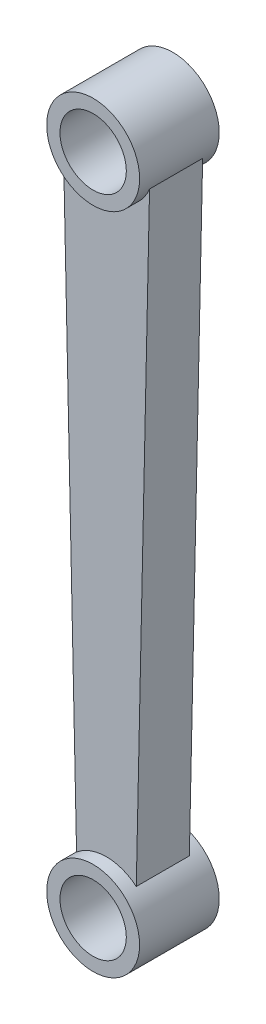
ISO-10303-21;
HEADER;
FILE_DESCRIPTION(('STEP AP214'),'2;1');
FILE_NAME('part.step','',(''),(''),'','','');
FILE_SCHEMA(('AUTOMOTIVE_DESIGN { 1 0 10303 214 1 1 1 1 }'));
ENDSEC;
DATA;
#1=APPLICATION_CONTEXT('core data for automotive mechanical design processes');
#2=APPLICATION_PROTOCOL_DEFINITION('international standard','automotive_design',2000,#1);
#3=PRODUCT_CONTEXT('',#1,'mechanical');
#4=PRODUCT('Part','Part','',(#3));
#5=PRODUCT_RELATED_PRODUCT_CATEGORY('part','',(#4));
#6=PRODUCT_DEFINITION_FORMATION('','',#4);
#7=PRODUCT_DEFINITION_CONTEXT('part definition',#1,'design');
#8=PRODUCT_DEFINITION('design','',#6,#7);
#9=PRODUCT_DEFINITION_SHAPE('','',#8);
#10=(LENGTH_UNIT() NAMED_UNIT(*) SI_UNIT(.MILLI.,.METRE.));
#11=(NAMED_UNIT(*) PLANE_ANGLE_UNIT() SI_UNIT($,.RADIAN.));
#12=(NAMED_UNIT(*) SI_UNIT($,.STERADIAN.) SOLID_ANGLE_UNIT());
#13=UNCERTAINTY_MEASURE_WITH_UNIT(LENGTH_MEASURE(1.E-05),#10,'distance_accuracy_value','');
#14=(GEOMETRIC_REPRESENTATION_CONTEXT(3) GLOBAL_UNCERTAINTY_ASSIGNED_CONTEXT((#13)) GLOBAL_UNIT_ASSIGNED_CONTEXT((#10,
#11,#12)) REPRESENTATION_CONTEXT('',''));
#15=CARTESIAN_POINT('',(0.,0.,0.));
#16=DIRECTION('',(0.,0.,1.));
#17=DIRECTION('',(1.,0.,0.));
#18=AXIS2_PLACEMENT_3D('',#15,#16,#17);
#19=CARTESIAN_POINT('',(0.,0.,-1.5));
#20=DIRECTION('',(0.,0.,1.));
#21=DIRECTION('',(1.,0.,0.));
#22=AXIS2_PLACEMENT_3D('',#19,#20,#21);
#23=CYLINDRICAL_SURFACE('',#22,1.75);
#24=CARTESIAN_POINT('',(0.,0.,1.));
#25=DIRECTION('',(0.,0.,1.));
#26=DIRECTION('',(1.,0.,0.));
#27=AXIS2_PLACEMENT_3D('',#24,#25,#26);
#28=CIRCLE('',#27,1.75);
#29=CARTESIAN_POINT('',(1.625,-0.649519052838329,1.));
#30=VERTEX_POINT('',#29);
#31=CARTESIAN_POINT('',(-1.625,-0.64951905283833,1.));
#32=VERTEX_POINT('',#31);
#33=EDGE_CURVE('E102',#30,#32,#28,.F.);
#34=ORIENTED_EDGE('',*,*,#33,.F.);
#35=DIRECTION('',(0.,0.,1.));
#36=VECTOR('',#35,1.);
#37=CARTESIAN_POINT('',(1.625,-0.649519052838329,-1.));
#38=LINE('',#37,#36);
#39=CARTESIAN_POINT('',(1.625,-0.649519052838332,-1.));
#40=VERTEX_POINT('',#39);
#41=EDGE_CURVE('E54',#40,#30,#38,.T.);
#42=ORIENTED_EDGE('',*,*,#41,.F.);
#43=CARTESIAN_POINT('',(0.,0.,-1.));
#44=DIRECTION('',(0.,0.,1.));
#45=DIRECTION('',(1.,0.,0.));
#46=AXIS2_PLACEMENT_3D('',#43,#44,#45);
#47=CIRCLE('',#46,1.75);
#48=CARTESIAN_POINT('',(-1.625,-0.649519052838331,-1.));
#49=VERTEX_POINT('',#48);
#50=EDGE_CURVE('E58',#40,#49,#47,.F.);
#51=ORIENTED_EDGE('',*,*,#50,.T.);
#52=DIRECTION('',(0.,0.,1.));
#53=VECTOR('',#52,1.);
#54=CARTESIAN_POINT('',(-1.625,-0.64951905283833,-1.));
#55=LINE('',#54,#53);
#56=EDGE_CURVE('E117',#49,#32,#55,.T.);
#57=ORIENTED_EDGE('',*,*,#56,.T.);
#58=EDGE_LOOP('',(#34,#42,#51,#57));
#59=FACE_BOUND('',#58,.T.);
#60=CARTESIAN_POINT('',(0.,0.,1.5));
#61=DIRECTION('',(0.,0.,1.));
#62=DIRECTION('',(1.,0.,0.));
#63=AXIS2_PLACEMENT_3D('',#60,#61,#62);
#64=CIRCLE('',#63,1.75);
#65=CARTESIAN_POINT('',(1.75,0.,1.5));
#66=VERTEX_POINT('',#65);
#67=EDGE_CURVE('E132',#66,#66,#64,.T.);
#68=ORIENTED_EDGE('',*,*,#67,.F.);
#69=EDGE_LOOP('',(#68));
#70=FACE_BOUND('',#69,.T.);
#71=CARTESIAN_POINT('',(0.,0.,-1.5));
#72=DIRECTION('',(0.,0.,1.));
#73=DIRECTION('',(1.,0.,0.));
#74=AXIS2_PLACEMENT_3D('',#71,#72,#73);
#75=CIRCLE('',#74,1.75);
#76=CARTESIAN_POINT('',(1.75,0.,-1.5));
#77=VERTEX_POINT('',#76);
#78=EDGE_CURVE('E47',#77,#77,#75,.T.);
#79=ORIENTED_EDGE('',*,*,#78,.T.);
#80=EDGE_LOOP('',(#79));
#81=FACE_BOUND('',#80,.T.);
#82=ADVANCED_FACE('F39',(#59,#70,#81),#23,.T.);
#83=CARTESIAN_POINT('',(0.,0.,-1.5));
#84=DIRECTION('',(0.,0.,1.));
#85=DIRECTION('',(1.,0.,0.));
#86=AXIS2_PLACEMENT_3D('',#83,#84,#85);
#87=PLANE('',#86);
#88=CARTESIAN_POINT('',(0.,0.,-1.5));
#89=DIRECTION('',(0.,0.,1.));
#90=DIRECTION('',(1.,0.,0.));
#91=AXIS2_PLACEMENT_3D('',#88,#89,#90);
#92=CIRCLE('',#91,1.25);
#93=CARTESIAN_POINT('',(1.25,0.,-1.5));
#94=VERTEX_POINT('',#93);
#95=EDGE_CURVE('E136',#94,#94,#92,.T.);
#96=ORIENTED_EDGE('',*,*,#95,.T.);
#97=EDGE_LOOP('',(#96));
#98=FACE_BOUND('',#97,.T.);
#99=ORIENTED_EDGE('',*,*,#78,.F.);
#100=EDGE_LOOP('',(#99));
#101=FACE_BOUND('',#100,.T.);
#102=ADVANCED_FACE('F144',(#98,#101),#87,.F.);
#103=CARTESIAN_POINT('',(0.,0.,-1.5));
#104=DIRECTION('',(0.,0.,1.));
#105=DIRECTION('',(1.,0.,0.));
#106=AXIS2_PLACEMENT_3D('',#103,#104,#105);
#107=CYLINDRICAL_SURFACE('',#106,1.25);
#108=CARTESIAN_POINT('',(0.,0.,1.5));
#109=DIRECTION('',(0.,0.,1.));
#110=DIRECTION('',(1.,0.,0.));
#111=AXIS2_PLACEMENT_3D('',#108,#109,#110);
#112=CIRCLE('',#111,1.25);
#113=CARTESIAN_POINT('',(1.25,0.,1.5));
#114=VERTEX_POINT('',#113);
#115=EDGE_CURVE('E128',#114,#114,#112,.T.);
#116=ORIENTED_EDGE('',*,*,#115,.T.);
#117=EDGE_LOOP('',(#116));
#118=FACE_BOUND('',#117,.T.);
#119=ORIENTED_EDGE('',*,*,#95,.F.);
#120=EDGE_LOOP('',(#119));
#121=FACE_BOUND('',#120,.T.);
#122=ADVANCED_FACE('F146',(#118,#121),#107,.F.);
#123=CARTESIAN_POINT('',(0.,0.,1.5));
#124=DIRECTION('',(0.,0.,1.));
#125=DIRECTION('',(1.,0.,0.));
#126=AXIS2_PLACEMENT_3D('',#123,#124,#125);
#127=PLANE('',#126);
#128=ORIENTED_EDGE('',*,*,#67,.T.);
#129=EDGE_LOOP('',(#128));
#130=FACE_BOUND('',#129,.T.);
#131=ORIENTED_EDGE('',*,*,#115,.F.);
#132=EDGE_LOOP('',(#131));
#133=FACE_BOUND('',#132,.T.);
#134=ADVANCED_FACE('F152',(#130,#133),#127,.T.);
#135=CARTESIAN_POINT('',(1.625,-0.649519052838329,-1.));
#136=DIRECTION('',(0.99976399412678,-0.0217245494238276,0.));
#137=DIRECTION('',(0.0217245494238276,0.99976399412678,0.));
#138=AXIS2_PLACEMENT_3D('',#135,#136,#137);
#139=PLANE('',#138);
#140=ORIENTED_EDGE('',*,*,#41,.T.);
#141=DIRECTION('',(0.0217245494238276,0.99976399412678,0.));
#142=VECTOR('',#141,1.);
#143=CARTESIAN_POINT('',(1.625,-0.649519052838329,1.));
#144=LINE('',#143,#142);
#145=CARTESIAN_POINT('',(1.125,-23.6595243381546,1.));
#146=VERTEX_POINT('',#145);
#147=EDGE_CURVE('E78',#146,#30,#144,.T.);
#148=ORIENTED_EDGE('',*,*,#147,.F.);
#149=DIRECTION('',(0.,0.,1.));
#150=VECTOR('',#149,1.);
#151=CARTESIAN_POINT('',(1.125,-23.6595243381546,-1.));
#152=LINE('',#151,#150);
#153=CARTESIAN_POINT('',(1.125,-23.6595243381546,-1.));
#154=VERTEX_POINT('',#153);
#155=EDGE_CURVE('E82',#154,#146,#152,.T.);
#156=ORIENTED_EDGE('',*,*,#155,.F.);
#157=DIRECTION('',(0.0217245494238276,0.99976399412678,0.));
#158=VECTOR('',#157,1.);
#159=CARTESIAN_POINT('',(1.625,-0.649519052838329,-1.));
#160=LINE('',#159,#158);
#161=EDGE_CURVE('E114',#154,#40,#160,.T.);
#162=ORIENTED_EDGE('',*,*,#161,.T.);
#163=EDGE_LOOP('',(#140,#148,#156,#162));
#164=FACE_BOUND('',#163,.T.);
#165=ADVANCED_FACE('F80',(#164),#139,.T.);
#166=CARTESIAN_POINT('',(0.,-25.,-1.));
#167=DIRECTION('',(0.,0.,1.));
#168=DIRECTION('',(1.,0.,0.));
#169=AXIS2_PLACEMENT_3D('',#166,#167,#168);
#170=CYLINDRICAL_SURFACE('',#169,1.75);
#171=ORIENTED_EDGE('',*,*,#155,.T.);
#172=CARTESIAN_POINT('',(0.,-25.,1.));
#173=DIRECTION('',(0.,0.,1.));
#174=DIRECTION('',(1.,0.,0.));
#175=AXIS2_PLACEMENT_3D('',#172,#173,#174);
#176=CIRCLE('',#175,1.75);
#177=CARTESIAN_POINT('',(-1.125,-23.6595243381546,1.));
#178=VERTEX_POINT('',#177);
#179=EDGE_CURVE('E11',#146,#178,#176,.T.);
#180=ORIENTED_EDGE('',*,*,#179,.T.);
#181=DIRECTION('',(0.,0.,1.));
#182=VECTOR('',#181,1.);
#183=CARTESIAN_POINT('',(-1.125,-23.6595243381546,-1.));
#184=LINE('',#183,#182);
#185=CARTESIAN_POINT('',(-1.125,-23.6595243381546,-1.));
#186=VERTEX_POINT('',#185);
#187=EDGE_CURVE('E97',#186,#178,#184,.T.);
#188=ORIENTED_EDGE('',*,*,#187,.F.);
#189=CARTESIAN_POINT('',(0.,-25.,-1.));
#190=DIRECTION('',(0.,0.,1.));
#191=DIRECTION('',(1.,0.,0.));
#192=AXIS2_PLACEMENT_3D('',#189,#190,#191);
#193=CIRCLE('',#192,1.75);
#194=EDGE_CURVE('E95',#154,#186,#193,.T.);
#195=ORIENTED_EDGE('',*,*,#194,.F.);
#196=EDGE_LOOP('',(#171,#180,#188,#195));
#197=FACE_BOUND('',#196,.T.);
#198=CARTESIAN_POINT('',(0.,-25.,1.5));
#199=DIRECTION('',(0.,0.,1.));
#200=DIRECTION('',(1.,0.,0.));
#201=AXIS2_PLACEMENT_3D('',#198,#199,#200);
#202=CIRCLE('',#201,1.75);
#203=CARTESIAN_POINT('',(1.75,-25.,1.5));
#204=VERTEX_POINT('',#203);
#205=EDGE_CURVE('E188',#204,#204,#202,.T.);
#206=ORIENTED_EDGE('',*,*,#205,.F.);
#207=EDGE_LOOP('',(#206));
#208=FACE_BOUND('',#207,.T.);
#209=CARTESIAN_POINT('',(0.,-25.,-1.5));
#210=DIRECTION('',(0.,0.,1.));
#211=DIRECTION('',(1.,0.,0.));
#212=AXIS2_PLACEMENT_3D('',#209,#210,#211);
#213=CIRCLE('',#212,1.75);
#214=CARTESIAN_POINT('',(1.75,-25.,-1.5));
#215=VERTEX_POINT('',#214);
#216=EDGE_CURVE('E107',#215,#215,#213,.T.);
#217=ORIENTED_EDGE('',*,*,#216,.T.);
#218=EDGE_LOOP('',(#217));
#219=FACE_BOUND('',#218,.T.);
#220=ADVANCED_FACE('F92',(#197,#208,#219),#170,.T.);
#221=CARTESIAN_POINT('',(-1.625,-0.64951905283833,-1.));
#222=DIRECTION('',(-0.99976399412678,-0.0217245494238279,0.));
#223=DIRECTION('',(0.0217245494238279,-0.99976399412678,0.));
#224=AXIS2_PLACEMENT_3D('',#221,#222,#223);
#225=PLANE('',#224);
#226=ORIENTED_EDGE('',*,*,#187,.T.);
#227=DIRECTION('',(0.0217245494238279,-0.99976399412678,0.));
#228=VECTOR('',#227,1.);
#229=CARTESIAN_POINT('',(-1.625,-0.64951905283833,1.));
#230=LINE('',#229,#228);
#231=EDGE_CURVE('E89',#32,#178,#230,.T.);
#232=ORIENTED_EDGE('',*,*,#231,.F.);
#233=ORIENTED_EDGE('',*,*,#56,.F.);
#234=DIRECTION('',(0.0217245494238279,-0.99976399412678,0.));
#235=VECTOR('',#234,1.);
#236=CARTESIAN_POINT('',(-1.625,-0.64951905283833,-1.));
#237=LINE('',#236,#235);
#238=EDGE_CURVE('E88',#49,#186,#237,.T.);
#239=ORIENTED_EDGE('',*,*,#238,.T.);
#240=EDGE_LOOP('',(#226,#232,#233,#239));
#241=FACE_BOUND('',#240,.T.);
#242=ADVANCED_FACE('F159',(#241),#225,.T.);
#243=CARTESIAN_POINT('',(0.,0.,-1.));
#244=DIRECTION('',(0.,0.,1.));
#245=DIRECTION('',(1.,0.,0.));
#246=AXIS2_PLACEMENT_3D('',#243,#244,#245);
#247=PLANE('',#246);
#248=ORIENTED_EDGE('',*,*,#161,.F.);
#249=ORIENTED_EDGE('',*,*,#194,.T.);
#250=ORIENTED_EDGE('',*,*,#238,.F.);
#251=ORIENTED_EDGE('',*,*,#50,.F.);
#252=EDGE_LOOP('',(#248,#249,#250,#251));
#253=FACE_BOUND('',#252,.T.);
#254=ADVANCED_FACE('F162',(#253),#247,.F.);
#255=CARTESIAN_POINT('',(0.,0.,1.));
#256=DIRECTION('',(0.,0.,1.));
#257=DIRECTION('',(1.,0.,0.));
#258=AXIS2_PLACEMENT_3D('',#255,#256,#257);
#259=PLANE('',#258);
#260=ORIENTED_EDGE('',*,*,#179,.F.);
#261=ORIENTED_EDGE('',*,*,#147,.T.);
#262=ORIENTED_EDGE('',*,*,#33,.T.);
#263=ORIENTED_EDGE('',*,*,#231,.T.);
#264=EDGE_LOOP('',(#260,#261,#262,#263));
#265=FACE_BOUND('',#264,.T.);
#266=ADVANCED_FACE('F100',(#265),#259,.T.);
#267=CARTESIAN_POINT('',(0.,-25.,1.5));
#268=DIRECTION('',(0.,0.,1.));
#269=DIRECTION('',(1.,0.,0.));
#270=AXIS2_PLACEMENT_3D('',#267,#268,#269);
#271=PLANE('',#270);
#272=ORIENTED_EDGE('',*,*,#205,.T.);
#273=EDGE_LOOP('',(#272));
#274=FACE_BOUND('',#273,.T.);
#275=CARTESIAN_POINT('',(0.,-25.,1.5));
#276=DIRECTION('',(0.,0.,1.));
#277=DIRECTION('',(1.,0.,0.));
#278=AXIS2_PLACEMENT_3D('',#275,#276,#277);
#279=CIRCLE('',#278,1.25);
#280=CARTESIAN_POINT('',(1.25000000000001,-25.,1.5));
#281=VERTEX_POINT('',#280);
#282=EDGE_CURVE('E191',#281,#281,#279,.T.);
#283=ORIENTED_EDGE('',*,*,#282,.F.);
#284=EDGE_LOOP('',(#283));
#285=FACE_BOUND('',#284,.T.);
#286=ADVANCED_FACE('F177',(#274,#285),#271,.T.);
#287=CARTESIAN_POINT('',(0.,-25.,-1.5));
#288=DIRECTION('',(0.,0.,1.));
#289=DIRECTION('',(1.,0.,0.));
#290=AXIS2_PLACEMENT_3D('',#287,#288,#289);
#291=PLANE('',#290);
#292=CARTESIAN_POINT('',(0.,-25.,-1.5));
#293=DIRECTION('',(0.,0.,1.));
#294=DIRECTION('',(1.,0.,0.));
#295=AXIS2_PLACEMENT_3D('',#292,#293,#294);
#296=CIRCLE('',#295,1.25);
#297=CARTESIAN_POINT('',(1.25000000000001,-25.,-1.5));
#298=VERTEX_POINT('',#297);
#299=EDGE_CURVE('E195',#298,#298,#296,.T.);
#300=ORIENTED_EDGE('',*,*,#299,.T.);
#301=EDGE_LOOP('',(#300));
#302=FACE_BOUND('',#301,.T.);
#303=ORIENTED_EDGE('',*,*,#216,.F.);
#304=EDGE_LOOP('',(#303));
#305=FACE_BOUND('',#304,.T.);
#306=ADVANCED_FACE('F173',(#302,#305),#291,.F.);
#307=CARTESIAN_POINT('',(0.,-25.,-1.));
#308=DIRECTION('',(0.,0.,1.));
#309=DIRECTION('',(1.,0.,0.));
#310=AXIS2_PLACEMENT_3D('',#307,#308,#309);
#311=CYLINDRICAL_SURFACE('',#310,1.25);
#312=ORIENTED_EDGE('',*,*,#282,.T.);
#313=EDGE_LOOP('',(#312));
#314=FACE_BOUND('',#313,.T.);
#315=ORIENTED_EDGE('',*,*,#299,.F.);
#316=EDGE_LOOP('',(#315));
#317=FACE_BOUND('',#316,.T.);
#318=ADVANCED_FACE('F170',(#314,#317),#311,.F.);
#319=CLOSED_SHELL('',(#82,#102,#122,#134,#165,#220,#242,#254,#266,#286,#306,#318));
#320=MANIFOLD_SOLID_BREP('B2',#319);
#321=ADVANCED_BREP_SHAPE_REPRESENTATION('',(#18,#320),#14);
#322=SHAPE_DEFINITION_REPRESENTATION(#9,#321);
ENDSEC;
END-ISO-10303-21;
